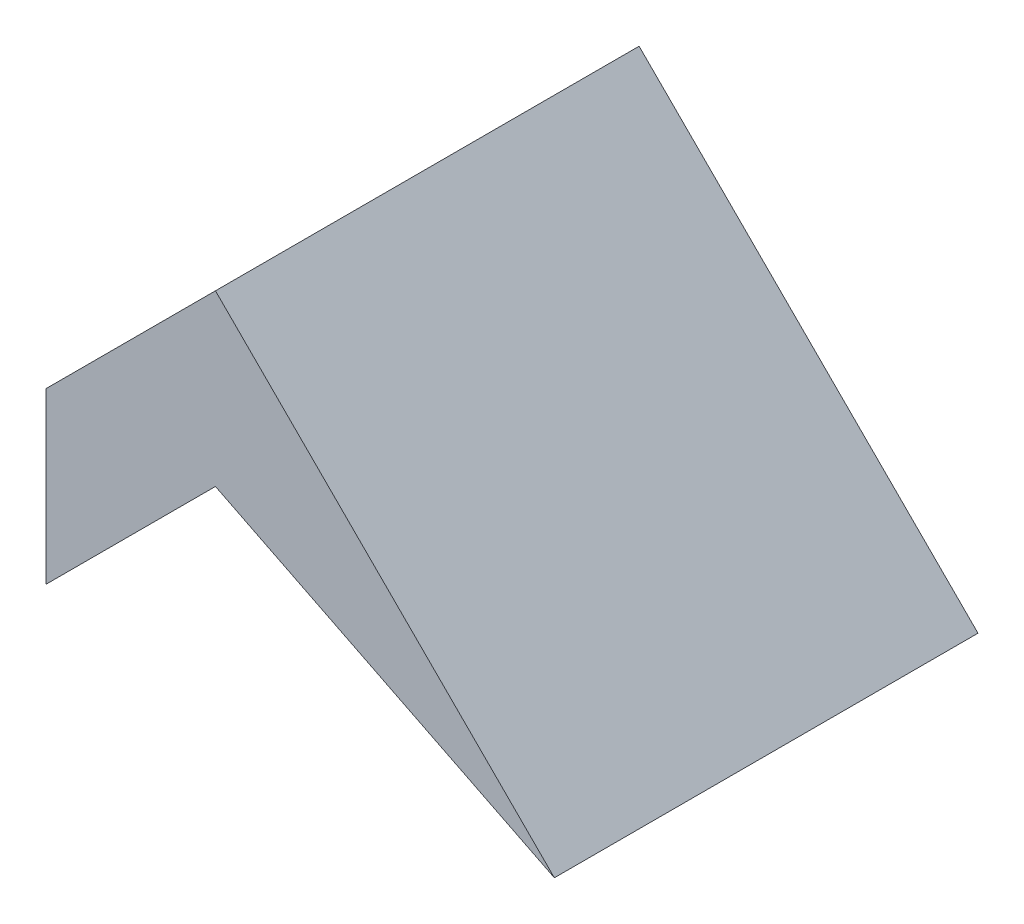
ISO-10303-21;
HEADER;
FILE_DESCRIPTION(('STEP AP214'),'2;1');
FILE_NAME('part.step','',(''),(''),'','','');
FILE_SCHEMA(('AUTOMOTIVE_DESIGN { 1 0 10303 214 1 1 1 1 }'));
ENDSEC;
DATA;
#1=APPLICATION_CONTEXT('core data for automotive mechanical design processes');
#2=APPLICATION_PROTOCOL_DEFINITION('international standard','automotive_design',2000,#1);
#3=PRODUCT_CONTEXT('',#1,'mechanical');
#4=PRODUCT('Part','Part','',(#3));
#5=PRODUCT_RELATED_PRODUCT_CATEGORY('part','',(#4));
#6=PRODUCT_DEFINITION_FORMATION('','',#4);
#7=PRODUCT_DEFINITION_CONTEXT('part definition',#1,'design');
#8=PRODUCT_DEFINITION('design','',#6,#7);
#9=PRODUCT_DEFINITION_SHAPE('','',#8);
#10=(LENGTH_UNIT() NAMED_UNIT(*) SI_UNIT(.MILLI.,.METRE.));
#11=(NAMED_UNIT(*) PLANE_ANGLE_UNIT() SI_UNIT($,.RADIAN.));
#12=(NAMED_UNIT(*) SI_UNIT($,.STERADIAN.) SOLID_ANGLE_UNIT());
#13=UNCERTAINTY_MEASURE_WITH_UNIT(LENGTH_MEASURE(1.E-05),#10,'distance_accuracy_value','');
#14=(GEOMETRIC_REPRESENTATION_CONTEXT(3) GLOBAL_UNCERTAINTY_ASSIGNED_CONTEXT((#13)) GLOBAL_UNIT_ASSIGNED_CONTEXT((#10,
#11,#12)) REPRESENTATION_CONTEXT('',''));
#15=CARTESIAN_POINT('',(0.,0.,0.));
#16=DIRECTION('',(0.,0.,1.));
#17=DIRECTION('',(1.,0.,0.));
#18=AXIS2_PLACEMENT_3D('',#15,#16,#17);
#19=CARTESIAN_POINT('',(-10.,-20.,25.));
#20=DIRECTION('',(1.,0.,0.));
#21=DIRECTION('',(0.,0.,-1.));
#22=AXIS2_PLACEMENT_3D('',#19,#20,#21);
#23=PLANE('',#22);
#24=DIRECTION('',(0.,-1.,0.));
#25=VECTOR('',#24,1.);
#26=CARTESIAN_POINT('',(-10.,-20.,0.));
#27=LINE('',#26,#25);
#28=CARTESIAN_POINT('',(-10.,-10.,0.));
#29=VERTEX_POINT('',#28);
#30=CARTESIAN_POINT('',(-10.,-20.,0.));
#31=VERTEX_POINT('',#30);
#32=EDGE_CURVE('E107',#29,#31,#27,.T.);
#33=ORIENTED_EDGE('',*,*,#32,.T.);
#34=DIRECTION('',(0.,0.,-1.));
#35=VECTOR('',#34,1.);
#36=CARTESIAN_POINT('',(-10.,-20.,25.));
#37=LINE('',#36,#35);
#38=CARTESIAN_POINT('',(-10.,-20.,25.));
#39=VERTEX_POINT('',#38);
#40=EDGE_CURVE('E11',#39,#31,#37,.T.);
#41=ORIENTED_EDGE('',*,*,#40,.F.);
#42=DIRECTION('',(0.,-1.,0.));
#43=VECTOR('',#42,1.);
#44=CARTESIAN_POINT('',(-10.,-20.,25.));
#45=LINE('',#44,#43);
#46=CARTESIAN_POINT('',(-10.,-10.,25.));
#47=VERTEX_POINT('',#46);
#48=EDGE_CURVE('E115',#47,#39,#45,.T.);
#49=ORIENTED_EDGE('',*,*,#48,.F.);
#50=DIRECTION('',(0.,0.,-1.));
#51=VECTOR('',#50,1.);
#52=CARTESIAN_POINT('',(-10.,-10.,25.));
#53=LINE('',#52,#51);
#54=EDGE_CURVE('E103',#47,#29,#53,.T.);
#55=ORIENTED_EDGE('',*,*,#54,.T.);
#56=EDGE_LOOP('',(#33,#41,#49,#55));
#57=FACE_BOUND('',#56,.T.);
#58=ADVANCED_FACE('F33',(#57),#23,.F.);
#59=CARTESIAN_POINT('',(0.,-10.,25.));
#60=DIRECTION('',(-0.707106781186547,0.707106781186548,0.));
#61=DIRECTION('',(-0.707106781186548,-0.707106781186547,0.));
#62=AXIS2_PLACEMENT_3D('',#59,#60,#61);
#63=PLANE('',#62);
#64=DIRECTION('',(0.707106781186548,0.707106781186547,0.));
#65=VECTOR('',#64,1.);
#66=CARTESIAN_POINT('',(0.,-10.,0.));
#67=LINE('',#66,#65);
#68=CARTESIAN_POINT('',(0.,-10.,0.));
#69=VERTEX_POINT('',#68);
#70=EDGE_CURVE('E110',#31,#69,#67,.T.);
#71=ORIENTED_EDGE('',*,*,#70,.T.);
#72=DIRECTION('',(0.,0.,-1.));
#73=VECTOR('',#72,1.);
#74=CARTESIAN_POINT('',(0.,-10.,25.));
#75=LINE('',#74,#73);
#76=CARTESIAN_POINT('',(0.,-10.,25.));
#77=VERTEX_POINT('',#76);
#78=EDGE_CURVE('E41',#77,#69,#75,.T.);
#79=ORIENTED_EDGE('',*,*,#78,.F.);
#80=DIRECTION('',(0.707106781186548,0.707106781186547,0.));
#81=VECTOR('',#80,1.);
#82=CARTESIAN_POINT('',(0.,-10.,25.));
#83=LINE('',#82,#81);
#84=EDGE_CURVE('E83',#39,#77,#83,.T.);
#85=ORIENTED_EDGE('',*,*,#84,.F.);
#86=ORIENTED_EDGE('',*,*,#40,.T.);
#87=EDGE_LOOP('',(#71,#79,#85,#86));
#88=FACE_BOUND('',#87,.T.);
#89=ADVANCED_FACE('F134',(#88),#63,.F.);
#90=CARTESIAN_POINT('',(20.,-20.,25.));
#91=DIRECTION('',(0.447213595499958,0.894427190999916,0.));
#92=DIRECTION('',(-0.894427190999916,0.447213595499958,0.));
#93=AXIS2_PLACEMENT_3D('',#90,#91,#92);
#94=PLANE('',#93);
#95=DIRECTION('',(0.894427190999916,-0.447213595499958,0.));
#96=VECTOR('',#95,1.);
#97=CARTESIAN_POINT('',(20.,-20.,0.));
#98=LINE('',#97,#96);
#99=CARTESIAN_POINT('',(20.,-20.,0.));
#100=VERTEX_POINT('',#99);
#101=EDGE_CURVE('E98',#69,#100,#98,.T.);
#102=ORIENTED_EDGE('',*,*,#101,.T.);
#103=DIRECTION('',(0.,0.,-1.));
#104=VECTOR('',#103,1.);
#105=CARTESIAN_POINT('',(20.,-20.,25.));
#106=LINE('',#105,#104);
#107=CARTESIAN_POINT('',(20.,-20.,25.));
#108=VERTEX_POINT('',#107);
#109=EDGE_CURVE('E95',#108,#100,#106,.T.);
#110=ORIENTED_EDGE('',*,*,#109,.F.);
#111=DIRECTION('',(0.894427190999916,-0.447213595499958,0.));
#112=VECTOR('',#111,1.);
#113=CARTESIAN_POINT('',(20.,-20.,25.));
#114=LINE('',#113,#112);
#115=EDGE_CURVE('E87',#77,#108,#114,.T.);
#116=ORIENTED_EDGE('',*,*,#115,.F.);
#117=ORIENTED_EDGE('',*,*,#78,.T.);
#118=EDGE_LOOP('',(#102,#110,#116,#117));
#119=FACE_BOUND('',#118,.T.);
#120=ADVANCED_FACE('F96',(#119),#94,.F.);
#121=CARTESIAN_POINT('',(0.,0.,25.));
#122=DIRECTION('',(-0.707106781186547,-0.707106781186548,0.));
#123=DIRECTION('',(0.707106781186548,-0.707106781186547,0.));
#124=AXIS2_PLACEMENT_3D('',#121,#122,#123);
#125=PLANE('',#124);
#126=DIRECTION('',(-0.707106781186548,0.707106781186547,0.));
#127=VECTOR('',#126,1.);
#128=CARTESIAN_POINT('',(0.,0.,0.));
#129=LINE('',#128,#127);
#130=CARTESIAN_POINT('',(0.,0.,0.));
#131=VERTEX_POINT('',#130);
#132=EDGE_CURVE('E69',#100,#131,#129,.T.);
#133=ORIENTED_EDGE('',*,*,#132,.T.);
#134=DIRECTION('',(0.,0.,-1.));
#135=VECTOR('',#134,1.);
#136=CARTESIAN_POINT('',(0.,0.,25.));
#137=LINE('',#136,#135);
#138=CARTESIAN_POINT('',(0.,0.,25.));
#139=VERTEX_POINT('',#138);
#140=EDGE_CURVE('E99',#139,#131,#137,.T.);
#141=ORIENTED_EDGE('',*,*,#140,.F.);
#142=DIRECTION('',(-0.707106781186548,0.707106781186547,0.));
#143=VECTOR('',#142,1.);
#144=CARTESIAN_POINT('',(0.,0.,25.));
#145=LINE('',#144,#143);
#146=EDGE_CURVE('E91',#108,#139,#145,.T.);
#147=ORIENTED_EDGE('',*,*,#146,.F.);
#148=ORIENTED_EDGE('',*,*,#109,.T.);
#149=EDGE_LOOP('',(#133,#141,#147,#148));
#150=FACE_BOUND('',#149,.T.);
#151=ADVANCED_FACE('F101',(#150),#125,.F.);
#152=CARTESIAN_POINT('',(-10.,-10.,25.));
#153=DIRECTION('',(0.707106781186547,-0.707106781186548,0.));
#154=DIRECTION('',(0.707106781186548,0.707106781186547,0.));
#155=AXIS2_PLACEMENT_3D('',#152,#153,#154);
#156=PLANE('',#155);
#157=DIRECTION('',(-0.707106781186548,-0.707106781186547,0.));
#158=VECTOR('',#157,1.);
#159=CARTESIAN_POINT('',(-10.,-10.,0.));
#160=LINE('',#159,#158);
#161=EDGE_CURVE('E75',#131,#29,#160,.T.);
#162=ORIENTED_EDGE('',*,*,#161,.T.);
#163=ORIENTED_EDGE('',*,*,#54,.F.);
#164=DIRECTION('',(-0.707106781186548,-0.707106781186547,0.));
#165=VECTOR('',#164,1.);
#166=CARTESIAN_POINT('',(-10.,-10.,25.));
#167=LINE('',#166,#165);
#168=EDGE_CURVE('E49',#139,#47,#167,.T.);
#169=ORIENTED_EDGE('',*,*,#168,.F.);
#170=ORIENTED_EDGE('',*,*,#140,.T.);
#171=EDGE_LOOP('',(#162,#163,#169,#170));
#172=FACE_BOUND('',#171,.T.);
#173=ADVANCED_FACE('F123',(#172),#156,.F.);
#174=CARTESIAN_POINT('',(0.,0.,25.));
#175=DIRECTION('',(0.,0.,1.));
#176=DIRECTION('',(1.,0.,0.));
#177=AXIS2_PLACEMENT_3D('',#174,#175,#176);
#178=PLANE('',#177);
#179=ORIENTED_EDGE('',*,*,#48,.T.);
#180=ORIENTED_EDGE('',*,*,#84,.T.);
#181=ORIENTED_EDGE('',*,*,#115,.T.);
#182=ORIENTED_EDGE('',*,*,#146,.T.);
#183=ORIENTED_EDGE('',*,*,#168,.T.);
#184=EDGE_LOOP('',(#179,#180,#181,#182,#183));
#185=FACE_BOUND('',#184,.T.);
#186=ADVANCED_FACE('F89',(#185),#178,.T.);
#187=CARTESIAN_POINT('',(0.,0.,0.));
#188=DIRECTION('',(0.,0.,1.));
#189=DIRECTION('',(1.,0.,0.));
#190=AXIS2_PLACEMENT_3D('',#187,#188,#189);
#191=PLANE('',#190);
#192=ORIENTED_EDGE('',*,*,#32,.F.);
#193=ORIENTED_EDGE('',*,*,#161,.F.);
#194=ORIENTED_EDGE('',*,*,#132,.F.);
#195=ORIENTED_EDGE('',*,*,#101,.F.);
#196=ORIENTED_EDGE('',*,*,#70,.F.);
#197=EDGE_LOOP('',(#192,#193,#194,#195,#196));
#198=FACE_BOUND('',#197,.T.);
#199=ADVANCED_FACE('F119',(#198),#191,.F.);
#200=CLOSED_SHELL('',(#58,#89,#120,#151,#173,#186,#199));
#201=MANIFOLD_SOLID_BREP('B2',#200);
#202=ADVANCED_BREP_SHAPE_REPRESENTATION('',(#18,#201),#14);
#203=SHAPE_DEFINITION_REPRESENTATION(#9,#202);
ENDSEC;
END-ISO-10303-21;
